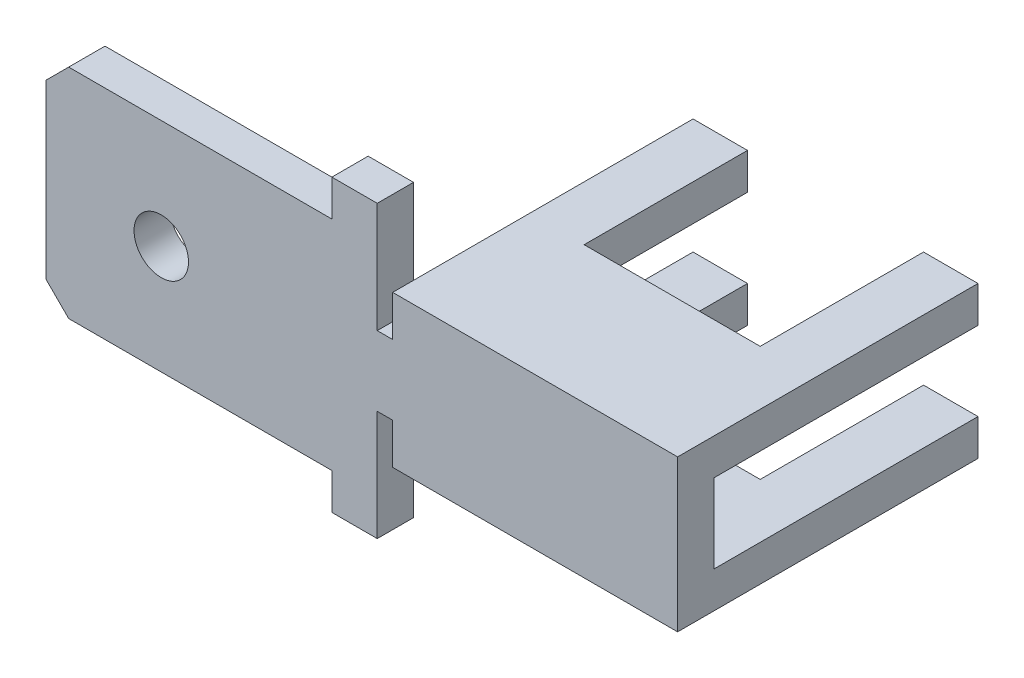
ISO-10303-21;
HEADER;
FILE_DESCRIPTION(('STEP AP214'),'2;1');
FILE_NAME('part.step','',(''),(''),'','','');
FILE_SCHEMA(('AUTOMOTIVE_DESIGN { 1 0 10303 214 1 1 1 1 }'));
ENDSEC;
DATA;
#1=APPLICATION_CONTEXT('core data for automotive mechanical design processes');
#2=APPLICATION_PROTOCOL_DEFINITION('international standard','automotive_design',2000,#1);
#3=PRODUCT_CONTEXT('',#1,'mechanical');
#4=PRODUCT('Part','Part','',(#3));
#5=PRODUCT_RELATED_PRODUCT_CATEGORY('part','',(#4));
#6=PRODUCT_DEFINITION_FORMATION('','',#4);
#7=PRODUCT_DEFINITION_CONTEXT('part definition',#1,'design');
#8=PRODUCT_DEFINITION('design','',#6,#7);
#9=PRODUCT_DEFINITION_SHAPE('','',#8);
#10=(LENGTH_UNIT() NAMED_UNIT(*) SI_UNIT(.MILLI.,.METRE.));
#11=(NAMED_UNIT(*) PLANE_ANGLE_UNIT() SI_UNIT($,.RADIAN.));
#12=(NAMED_UNIT(*) SI_UNIT($,.STERADIAN.) SOLID_ANGLE_UNIT());
#13=UNCERTAINTY_MEASURE_WITH_UNIT(LENGTH_MEASURE(1.E-05),#10,'distance_accuracy_value','');
#14=(GEOMETRIC_REPRESENTATION_CONTEXT(3) GLOBAL_UNCERTAINTY_ASSIGNED_CONTEXT((#13)) GLOBAL_UNIT_ASSIGNED_CONTEXT((#10,
#11,#12)) REPRESENTATION_CONTEXT('',''));
#15=CARTESIAN_POINT('',(0.,0.,0.));
#16=DIRECTION('',(0.,0.,1.));
#17=DIRECTION('',(1.,0.,0.));
#18=AXIS2_PLACEMENT_3D('',#15,#16,#17);
#19=CARTESIAN_POINT('',(0.,0.,6.62));
#20=DIRECTION('',(0.,0.,1.));
#21=DIRECTION('',(1.,0.,0.));
#22=AXIS2_PLACEMENT_3D('',#19,#20,#21);
#23=PLANE('',#22);
#24=CARTESIAN_POINT('',(0.,0.,6.62));
#25=DIRECTION('',(0.,0.,1.));
#26=DIRECTION('',(1.,0.,0.));
#27=AXIS2_PLACEMENT_3D('',#24,#25,#26);
#28=CIRCLE('',#27,0.6);
#29=CARTESIAN_POINT('',(0.6,0.,6.62));
#30=VERTEX_POINT('',#29);
#31=EDGE_CURVE('E419',#30,#30,#28,.T.);
#32=ORIENTED_EDGE('',*,*,#31,.F.);
#33=EDGE_LOOP('',(#32));
#34=FACE_BOUND('',#33,.T.);
#35=DIRECTION('',(1.,0.,0.));
#36=VECTOR('',#35,1.);
#37=CARTESIAN_POINT('',(4.76,1.67,6.62));
#38=LINE('',#37,#36);
#39=CARTESIAN_POINT('',(5.1,1.67,6.62));
#40=VERTEX_POINT('',#39);
#41=CARTESIAN_POINT('',(11.38,1.67,6.62));
#42=VERTEX_POINT('',#41);
#43=EDGE_CURVE('E362',#40,#42,#38,.T.);
#44=ORIENTED_EDGE('',*,*,#43,.F.);
#45=DIRECTION('',(0.,1.,0.));
#46=VECTOR('',#45,1.);
#47=CARTESIAN_POINT('',(5.1,0.77,6.62));
#48=LINE('',#47,#46);
#49=CARTESIAN_POINT('',(5.1,0.77,6.62));
#50=VERTEX_POINT('',#49);
#51=EDGE_CURVE('E256',#50,#40,#48,.T.);
#52=ORIENTED_EDGE('',*,*,#51,.F.);
#53=DIRECTION('',(-1.,0.,0.));
#54=VECTOR('',#53,1.);
#55=CARTESIAN_POINT('',(5.1,0.77,6.62));
#56=LINE('',#55,#54);
#57=CARTESIAN_POINT('',(4.76,0.77,6.62));
#58=VERTEX_POINT('',#57);
#59=EDGE_CURVE('E257',#50,#58,#56,.T.);
#60=ORIENTED_EDGE('',*,*,#59,.T.);
#61=DIRECTION('',(0.,-1.,0.));
#62=VECTOR('',#61,1.);
#63=CARTESIAN_POINT('',(4.76,1.67,6.62));
#64=LINE('',#63,#62);
#65=CARTESIAN_POINT('',(4.76,3.2,6.62));
#66=VERTEX_POINT('',#65);
#67=EDGE_CURVE('E360',#66,#58,#64,.T.);
#68=ORIENTED_EDGE('',*,*,#67,.F.);
#69=DIRECTION('',(-1.,0.,0.));
#70=VECTOR('',#69,1.);
#71=CARTESIAN_POINT('',(11.38,3.2,6.62));
#72=LINE('',#71,#70);
#73=CARTESIAN_POINT('',(3.76,3.2,6.62));
#74=VERTEX_POINT('',#73);
#75=EDGE_CURVE('E438',#66,#74,#72,.T.);
#76=ORIENTED_EDGE('',*,*,#75,.T.);
#77=DIRECTION('',(0.,-1.,0.));
#78=VECTOR('',#77,1.);
#79=CARTESIAN_POINT('',(3.76,2.4,6.62));
#80=LINE('',#79,#78);
#81=CARTESIAN_POINT('',(3.76,2.4,6.62));
#82=VERTEX_POINT('',#81);
#83=EDGE_CURVE('E440',#74,#82,#80,.T.);
#84=ORIENTED_EDGE('',*,*,#83,.T.);
#85=DIRECTION('',(-1.,0.,0.));
#86=VECTOR('',#85,1.);
#87=CARTESIAN_POINT('',(3.76,2.4,6.62));
#88=LINE('',#87,#86);
#89=CARTESIAN_POINT('',(-2.04,2.4,6.62));
#90=VERTEX_POINT('',#89);
#91=EDGE_CURVE('E442',#82,#90,#88,.T.);
#92=ORIENTED_EDGE('',*,*,#91,.T.);
#93=DIRECTION('',(0.70710678118655,0.707106781186545,0.));
#94=VECTOR('',#93,1.);
#95=CARTESIAN_POINT('',(-2.21999999999999,2.22,6.62));
#96=LINE('',#95,#94);
#97=CARTESIAN_POINT('',(-2.54,1.9,6.62));
#98=VERTEX_POINT('',#97);
#99=EDGE_CURVE('E50',#90,#98,#96,.F.);
#100=ORIENTED_EDGE('',*,*,#99,.T.);
#101=DIRECTION('',(0.,-1.,0.));
#102=VECTOR('',#101,1.);
#103=CARTESIAN_POINT('',(-2.54,-2.4,6.62));
#104=LINE('',#103,#102);
#105=CARTESIAN_POINT('',(-2.54,-1.90000000000001,6.62));
#106=VERTEX_POINT('',#105);
#107=EDGE_CURVE('E423',#98,#106,#104,.T.);
#108=ORIENTED_EDGE('',*,*,#107,.T.);
#109=DIRECTION('',(-0.707106781186546,0.707106781186549,0.));
#110=VECTOR('',#109,1.);
#111=CARTESIAN_POINT('',(-2.22000000000001,-2.22,6.62));
#112=LINE('',#111,#110);
#113=CARTESIAN_POINT('',(-2.04,-2.40000000000001,6.62));
#114=VERTEX_POINT('',#113);
#115=EDGE_CURVE('E57',#106,#114,#112,.F.);
#116=ORIENTED_EDGE('',*,*,#115,.T.);
#117=DIRECTION('',(1.,0.,0.));
#118=VECTOR('',#117,1.);
#119=CARTESIAN_POINT('',(3.76,-2.4,6.62));
#120=LINE('',#119,#118);
#121=CARTESIAN_POINT('',(3.76,-2.4,6.62));
#122=VERTEX_POINT('',#121);
#123=EDGE_CURVE('E425',#114,#122,#120,.T.);
#124=ORIENTED_EDGE('',*,*,#123,.T.);
#125=DIRECTION('',(0.,-1.,0.));
#126=VECTOR('',#125,1.);
#127=CARTESIAN_POINT('',(3.76,-3.2,6.62));
#128=LINE('',#127,#126);
#129=CARTESIAN_POINT('',(3.76,-3.2,6.62));
#130=VERTEX_POINT('',#129);
#131=EDGE_CURVE('E429',#122,#130,#128,.T.);
#132=ORIENTED_EDGE('',*,*,#131,.T.);
#133=DIRECTION('',(1.,0.,0.));
#134=VECTOR('',#133,1.);
#135=CARTESIAN_POINT('',(11.38,-3.2,6.62));
#136=LINE('',#135,#134);
#137=CARTESIAN_POINT('',(4.76,-3.2,6.62));
#138=VERTEX_POINT('',#137);
#139=EDGE_CURVE('E431',#130,#138,#136,.T.);
#140=ORIENTED_EDGE('',*,*,#139,.T.);
#141=DIRECTION('',(0.,-1.,0.));
#142=VECTOR('',#141,1.);
#143=CARTESIAN_POINT('',(4.76,-1.67,6.62));
#144=LINE('',#143,#142);
#145=CARTESIAN_POINT('',(4.76,-0.77,6.62));
#146=VERTEX_POINT('',#145);
#147=EDGE_CURVE('E351',#146,#138,#144,.T.);
#148=ORIENTED_EDGE('',*,*,#147,.F.);
#149=DIRECTION('',(-1.,0.,0.));
#150=VECTOR('',#149,1.);
#151=CARTESIAN_POINT('',(5.1,-0.77,6.62));
#152=LINE('',#151,#150);
#153=CARTESIAN_POINT('',(5.1,-0.77,6.62));
#154=VERTEX_POINT('',#153);
#155=EDGE_CURVE('E279',#154,#146,#152,.T.);
#156=ORIENTED_EDGE('',*,*,#155,.F.);
#157=DIRECTION('',(0.,-1.,0.));
#158=VECTOR('',#157,1.);
#159=CARTESIAN_POINT('',(5.1,-0.77,6.62));
#160=LINE('',#159,#158);
#161=CARTESIAN_POINT('',(5.1,-1.67,6.62));
#162=VERTEX_POINT('',#161);
#163=EDGE_CURVE('E288',#154,#162,#160,.T.);
#164=ORIENTED_EDGE('',*,*,#163,.T.);
#165=DIRECTION('',(1.,0.,0.));
#166=VECTOR('',#165,1.);
#167=CARTESIAN_POINT('',(4.76,-1.67,6.62));
#168=LINE('',#167,#166);
#169=CARTESIAN_POINT('',(11.38,-1.67,6.62));
#170=VERTEX_POINT('',#169);
#171=EDGE_CURVE('E355',#162,#170,#168,.T.);
#172=ORIENTED_EDGE('',*,*,#171,.T.);
#173=DIRECTION('',(0.,1.,0.));
#174=VECTOR('',#173,1.);
#175=CARTESIAN_POINT('',(11.38,-3.2,6.62));
#176=LINE('',#175,#174);
#177=EDGE_CURVE('E434',#170,#42,#176,.T.);
#178=ORIENTED_EDGE('',*,*,#177,.T.);
#179=EDGE_LOOP('',(#44,#52,#60,#68,#76,#84,#92,#100,#108,#116,#124,#132,#140,#148,#156,#164,
#172,#178));
#180=FACE_BOUND('',#179,.T.);
#181=ADVANCED_FACE('F42',(#34,#180),#23,.T.);
#182=CARTESIAN_POINT('',(-2.54,-0.869999999999999,5.82));
#183=DIRECTION('',(0.,0.,1.));
#184=DIRECTION('',(1.,0.,0.));
#185=AXIS2_PLACEMENT_3D('',#182,#183,#184);
#186=PLANE('',#185);
#187=CARTESIAN_POINT('',(0.,0.,5.82));
#188=DIRECTION('',(0.,0.,1.));
#189=DIRECTION('',(1.,0.,0.));
#190=AXIS2_PLACEMENT_3D('',#187,#188,#189);
#191=CIRCLE('',#190,0.6);
#192=CARTESIAN_POINT('',(0.6,0.,5.82));
#193=VERTEX_POINT('',#192);
#194=EDGE_CURVE('E409',#193,#193,#191,.T.);
#195=ORIENTED_EDGE('',*,*,#194,.T.);
#196=EDGE_LOOP('',(#195));
#197=FACE_BOUND('',#196,.T.);
#198=DIRECTION('',(0.,1.,0.));
#199=VECTOR('',#198,1.);
#200=CARTESIAN_POINT('',(5.1,0.77,5.82));
#201=LINE('',#200,#199);
#202=CARTESIAN_POINT('',(5.1,0.77,5.82));
#203=VERTEX_POINT('',#202);
#204=CARTESIAN_POINT('',(5.1,0.869999999999999,5.82));
#205=VERTEX_POINT('',#204);
#206=EDGE_CURVE('E245',#203,#205,#201,.T.);
#207=ORIENTED_EDGE('',*,*,#206,.T.);
#208=DIRECTION('',(1.,0.,0.));
#209=VECTOR('',#208,1.);
#210=CARTESIAN_POINT('',(-2.54,0.869999999999999,5.82));
#211=LINE('',#210,#209);
#212=CARTESIAN_POINT('',(11.38,0.869999999999999,5.82));
#213=VERTEX_POINT('',#212);
#214=EDGE_CURVE('E413',#205,#213,#211,.T.);
#215=ORIENTED_EDGE('',*,*,#214,.T.);
#216=DIRECTION('',(0.,-1.,0.));
#217=VECTOR('',#216,1.);
#218=CARTESIAN_POINT('',(11.38,-0.869999999999999,5.82));
#219=LINE('',#218,#217);
#220=CARTESIAN_POINT('',(11.38,-0.869999999999999,5.82));
#221=VERTEX_POINT('',#220);
#222=EDGE_CURVE('E401',#213,#221,#219,.T.);
#223=ORIENTED_EDGE('',*,*,#222,.T.);
#224=DIRECTION('',(1.,0.,0.));
#225=VECTOR('',#224,1.);
#226=CARTESIAN_POINT('',(-2.54,-0.869999999999999,5.82));
#227=LINE('',#226,#225);
#228=CARTESIAN_POINT('',(5.1,-0.869999999999999,5.82));
#229=VERTEX_POINT('',#228);
#230=EDGE_CURVE('E411',#229,#221,#227,.T.);
#231=ORIENTED_EDGE('',*,*,#230,.F.);
#232=DIRECTION('',(0.,-1.,0.));
#233=VECTOR('',#232,1.);
#234=CARTESIAN_POINT('',(5.1,-0.77,5.82));
#235=LINE('',#234,#233);
#236=CARTESIAN_POINT('',(5.1,-0.77,5.82));
#237=VERTEX_POINT('',#236);
#238=EDGE_CURVE('E289',#237,#229,#235,.T.);
#239=ORIENTED_EDGE('',*,*,#238,.F.);
#240=DIRECTION('',(1.,0.,0.));
#241=VECTOR('',#240,1.);
#242=CARTESIAN_POINT('',(5.1,-0.77,5.82));
#243=LINE('',#242,#241);
#244=CARTESIAN_POINT('',(4.76,-0.77,5.82));
#245=VERTEX_POINT('',#244);
#246=EDGE_CURVE('E285',#245,#237,#243,.T.);
#247=ORIENTED_EDGE('',*,*,#246,.F.);
#248=DIRECTION('',(0.,1.,0.));
#249=VECTOR('',#248,1.);
#250=CARTESIAN_POINT('',(4.76,-1.67,5.82));
#251=LINE('',#250,#249);
#252=CARTESIAN_POINT('',(4.76,-3.2,5.82));
#253=VERTEX_POINT('',#252);
#254=EDGE_CURVE('E349',#253,#245,#251,.T.);
#255=ORIENTED_EDGE('',*,*,#254,.F.);
#256=DIRECTION('',(1.,0.,0.));
#257=VECTOR('',#256,1.);
#258=CARTESIAN_POINT('',(-2.54,-3.2,5.82));
#259=LINE('',#258,#257);
#260=CARTESIAN_POINT('',(3.76,-3.2,5.82));
#261=VERTEX_POINT('',#260);
#262=EDGE_CURVE('E369',#261,#253,#259,.T.);
#263=ORIENTED_EDGE('',*,*,#262,.F.);
#264=DIRECTION('',(0.,-1.,0.));
#265=VECTOR('',#264,1.);
#266=CARTESIAN_POINT('',(3.76,-3.2,5.82));
#267=LINE('',#266,#265);
#268=CARTESIAN_POINT('',(3.76,-2.4,5.82));
#269=VERTEX_POINT('',#268);
#270=EDGE_CURVE('E372',#269,#261,#267,.T.);
#271=ORIENTED_EDGE('',*,*,#270,.F.);
#272=DIRECTION('',(1.,0.,0.));
#273=VECTOR('',#272,1.);
#274=CARTESIAN_POINT('',(3.76,-2.4,5.82));
#275=LINE('',#274,#273);
#276=CARTESIAN_POINT('',(-2.04,-2.4,5.82));
#277=VERTEX_POINT('',#276);
#278=EDGE_CURVE('E378',#277,#269,#275,.T.);
#279=ORIENTED_EDGE('',*,*,#278,.F.);
#280=DIRECTION('',(0.707106781186546,-0.707106781186549,0.));
#281=VECTOR('',#280,1.);
#282=CARTESIAN_POINT('',(-2.04,-2.4,5.82));
#283=LINE('',#282,#281);
#284=CARTESIAN_POINT('',(-2.54,-1.90000000000001,5.82));
#285=VERTEX_POINT('',#284);
#286=EDGE_CURVE('E479',#277,#285,#283,.F.);
#287=ORIENTED_EDGE('',*,*,#286,.T.);
#288=DIRECTION('',(0.,-1.,0.));
#289=VECTOR('',#288,1.);
#290=CARTESIAN_POINT('',(-2.54,-0.869999999999999,5.82));
#291=LINE('',#290,#289);
#292=CARTESIAN_POINT('',(-2.54,1.89999999999999,5.82));
#293=VERTEX_POINT('',#292);
#294=EDGE_CURVE('E394',#293,#285,#291,.T.);
#295=ORIENTED_EDGE('',*,*,#294,.F.);
#296=DIRECTION('',(-0.70710678118655,-0.707106781186545,0.));
#297=VECTOR('',#296,1.);
#298=CARTESIAN_POINT('',(-2.54,1.9,5.82));
#299=LINE('',#298,#297);
#300=CARTESIAN_POINT('',(-2.04,2.4,5.82));
#301=VERTEX_POINT('',#300);
#302=EDGE_CURVE('E481',#293,#301,#299,.F.);
#303=ORIENTED_EDGE('',*,*,#302,.T.);
#304=DIRECTION('',(-1.,0.,0.));
#305=VECTOR('',#304,1.);
#306=CARTESIAN_POINT('',(3.76,2.4,5.82));
#307=LINE('',#306,#305);
#308=CARTESIAN_POINT('',(3.76,2.4,5.82));
#309=VERTEX_POINT('',#308);
#310=EDGE_CURVE('E458',#309,#301,#307,.T.);
#311=ORIENTED_EDGE('',*,*,#310,.F.);
#312=DIRECTION('',(0.,-1.,0.));
#313=VECTOR('',#312,1.);
#314=CARTESIAN_POINT('',(3.76,2.4,5.82));
#315=LINE('',#314,#313);
#316=CARTESIAN_POINT('',(3.76,3.2,5.82));
#317=VERTEX_POINT('',#316);
#318=EDGE_CURVE('E388',#317,#309,#315,.T.);
#319=ORIENTED_EDGE('',*,*,#318,.F.);
#320=DIRECTION('',(1.,0.,0.));
#321=VECTOR('',#320,1.);
#322=CARTESIAN_POINT('',(-2.54,3.2,5.82));
#323=LINE('',#322,#321);
#324=CARTESIAN_POINT('',(4.76,3.2,5.82));
#325=VERTEX_POINT('',#324);
#326=EDGE_CURVE('E384',#317,#325,#323,.T.);
#327=ORIENTED_EDGE('',*,*,#326,.T.);
#328=DIRECTION('',(0.,1.,0.));
#329=VECTOR('',#328,1.);
#330=CARTESIAN_POINT('',(4.76,1.67,5.82));
#331=LINE('',#330,#329);
#332=CARTESIAN_POINT('',(4.76,0.77,5.82));
#333=VERTEX_POINT('',#332);
#334=EDGE_CURVE('E268',#333,#325,#331,.T.);
#335=ORIENTED_EDGE('',*,*,#334,.F.);
#336=DIRECTION('',(1.,0.,0.));
#337=VECTOR('',#336,1.);
#338=CARTESIAN_POINT('',(5.1,0.77,5.82));
#339=LINE('',#338,#337);
#340=EDGE_CURVE('E263',#333,#203,#339,.T.);
#341=ORIENTED_EDGE('',*,*,#340,.T.);
#342=EDGE_LOOP('',(#207,#215,#223,#231,#239,#247,#255,#263,#271,#279,#287,#295,#303,#311,#319,
#327,#335,#341));
#343=FACE_BOUND('',#342,.T.);
#344=ADVANCED_FACE('F266',(#197,#343),#186,.F.);
#345=CARTESIAN_POINT('',(-2.54,1.67,0.));
#346=DIRECTION('',(0.,-1.,0.));
#347=DIRECTION('',(0.,0.,-1.));
#348=AXIS2_PLACEMENT_3D('',#345,#346,#347);
#349=PLANE('',#348);
#350=DIRECTION('',(0.,0.,1.));
#351=VECTOR('',#350,1.);
#352=CARTESIAN_POINT('',(5.1,1.67,0.));
#353=LINE('',#352,#351);
#354=CARTESIAN_POINT('',(5.1,1.67,0.));
#355=VERTEX_POINT('',#354);
#356=EDGE_CURVE('E341',#355,#40,#353,.T.);
#357=ORIENTED_EDGE('',*,*,#356,.T.);
#358=ORIENTED_EDGE('',*,*,#43,.T.);
#359=DIRECTION('',(0.,0.,-1.));
#360=VECTOR('',#359,1.);
#361=CARTESIAN_POINT('',(11.38,1.67,0.));
#362=LINE('',#361,#360);
#363=CARTESIAN_POINT('',(11.38,1.67,0.));
#364=VERTEX_POINT('',#363);
#365=EDGE_CURVE('E380',#42,#364,#362,.T.);
#366=ORIENTED_EDGE('',*,*,#365,.T.);
#367=DIRECTION('',(1.,0.,0.));
#368=VECTOR('',#367,1.);
#369=CARTESIAN_POINT('',(-2.54,1.67,0.));
#370=LINE('',#369,#368);
#371=CARTESIAN_POINT('',(10.18,1.67,0.));
#372=VERTEX_POINT('',#371);
#373=EDGE_CURVE('E389',#372,#364,#370,.T.);
#374=ORIENTED_EDGE('',*,*,#373,.F.);
#375=DIRECTION('',(0.,0.,1.));
#376=VECTOR('',#375,1.);
#377=CARTESIAN_POINT('',(10.18,1.67,0.));
#378=LINE('',#377,#376);
#379=CARTESIAN_POINT('',(10.18,1.67,3.6));
#380=VERTEX_POINT('',#379);
#381=EDGE_CURVE('E318',#372,#380,#378,.T.);
#382=ORIENTED_EDGE('',*,*,#381,.T.);
#383=DIRECTION('',(-1.,0.,0.));
#384=VECTOR('',#383,1.);
#385=CARTESIAN_POINT('',(-2.54,1.67,3.6));
#386=LINE('',#385,#384);
#387=CARTESIAN_POINT('',(6.3,1.67,3.6));
#388=VERTEX_POINT('',#387);
#389=EDGE_CURVE('E327',#380,#388,#386,.T.);
#390=ORIENTED_EDGE('',*,*,#389,.T.);
#391=DIRECTION('',(0.,0.,-1.));
#392=VECTOR('',#391,1.);
#393=CARTESIAN_POINT('',(6.3,1.67,0.));
#394=LINE('',#393,#392);
#395=CARTESIAN_POINT('',(6.3,1.67,0.));
#396=VERTEX_POINT('',#395);
#397=EDGE_CURVE('E307',#388,#396,#394,.T.);
#398=ORIENTED_EDGE('',*,*,#397,.T.);
#399=EDGE_CURVE('E385',#355,#396,#370,.T.);
#400=ORIENTED_EDGE('',*,*,#399,.F.);
#401=EDGE_LOOP('',(#357,#358,#366,#374,#382,#390,#398,#400));
#402=FACE_BOUND('',#401,.T.);
#403=ADVANCED_FACE('F515',(#402),#349,.F.);
#404=CARTESIAN_POINT('',(0.,0.,0.));
#405=DIRECTION('',(0.,0.,1.));
#406=DIRECTION('',(1.,0.,0.));
#407=AXIS2_PLACEMENT_3D('',#404,#405,#406);
#408=PLANE('',#407);
#409=DIRECTION('',(1.,0.,0.));
#410=VECTOR('',#409,1.);
#411=CARTESIAN_POINT('',(-2.54,-1.67,0.));
#412=LINE('',#411,#410);
#413=CARTESIAN_POINT('',(10.18,-1.67,0.));
#414=VERTEX_POINT('',#413);
#415=CARTESIAN_POINT('',(11.38,-1.67,0.));
#416=VERTEX_POINT('',#415);
#417=EDGE_CURVE('E368',#414,#416,#412,.T.);
#418=ORIENTED_EDGE('',*,*,#417,.F.);
#419=DIRECTION('',(0.,-1.,0.));
#420=VECTOR('',#419,1.);
#421=CARTESIAN_POINT('',(10.18,3.2,0.));
#422=LINE('',#421,#420);
#423=CARTESIAN_POINT('',(10.18,-0.869999999999999,0.));
#424=VERTEX_POINT('',#423);
#425=EDGE_CURVE('E299',#424,#414,#422,.T.);
#426=ORIENTED_EDGE('',*,*,#425,.F.);
#427=DIRECTION('',(1.,0.,0.));
#428=VECTOR('',#427,1.);
#429=CARTESIAN_POINT('',(-2.54,-0.869999999999999,0.));
#430=LINE('',#429,#428);
#431=CARTESIAN_POINT('',(11.38,-0.869999999999999,0.));
#432=VERTEX_POINT('',#431);
#433=EDGE_CURVE('E410',#424,#432,#430,.T.);
#434=ORIENTED_EDGE('',*,*,#433,.T.);
#435=DIRECTION('',(0.,1.,0.));
#436=VECTOR('',#435,1.);
#437=CARTESIAN_POINT('',(11.38,-3.2,0.));
#438=LINE('',#437,#436);
#439=EDGE_CURVE('E426',#416,#432,#438,.T.);
#440=ORIENTED_EDGE('',*,*,#439,.F.);
#441=EDGE_LOOP('',(#418,#426,#434,#440));
#442=FACE_BOUND('',#441,.T.);
#443=ADVANCED_FACE('F594',(#442),#408,.F.);
#444=DIRECTION('',(1.,0.,0.));
#445=VECTOR('',#444,1.);
#446=CARTESIAN_POINT('',(-2.54,0.869999999999999,0.));
#447=LINE('',#446,#445);
#448=CARTESIAN_POINT('',(10.18,0.869999999999999,0.));
#449=VERTEX_POINT('',#448);
#450=CARTESIAN_POINT('',(11.38,0.869999999999999,0.));
#451=VERTEX_POINT('',#450);
#452=EDGE_CURVE('E397',#449,#451,#447,.T.);
#453=ORIENTED_EDGE('',*,*,#452,.F.);
#454=EDGE_CURVE('E298',#372,#449,#422,.T.);
#455=ORIENTED_EDGE('',*,*,#454,.F.);
#456=ORIENTED_EDGE('',*,*,#373,.T.);
#457=EDGE_CURVE('E422',#451,#364,#438,.T.);
#458=ORIENTED_EDGE('',*,*,#457,.F.);
#459=EDGE_LOOP('',(#453,#455,#456,#458));
#460=FACE_BOUND('',#459,.T.);
#461=ADVANCED_FACE('F601',(#460),#408,.F.);
#462=CARTESIAN_POINT('',(11.38,3.2,6.62));
#463=DIRECTION('',(0.,-1.,0.));
#464=DIRECTION('',(1.,0.,0.));
#465=AXIS2_PLACEMENT_3D('',#462,#463,#464);
#466=PLANE('',#465);
#467=DIRECTION('',(0.,0.,1.));
#468=VECTOR('',#467,1.);
#469=CARTESIAN_POINT('',(4.76,3.2,5.82));
#470=LINE('',#469,#468);
#471=EDGE_CURVE('E358',#325,#66,#470,.T.);
#472=ORIENTED_EDGE('',*,*,#471,.F.);
#473=ORIENTED_EDGE('',*,*,#326,.F.);
#474=DIRECTION('',(0.,0.,-1.));
#475=VECTOR('',#474,1.);
#476=CARTESIAN_POINT('',(3.76,3.2,6.62));
#477=LINE('',#476,#475);
#478=EDGE_CURVE('E449',#74,#317,#477,.T.);
#479=ORIENTED_EDGE('',*,*,#478,.F.);
#480=ORIENTED_EDGE('',*,*,#75,.F.);
#481=EDGE_LOOP('',(#472,#473,#479,#480));
#482=FACE_BOUND('',#481,.T.);
#483=ADVANCED_FACE('F503',(#482),#466,.F.);
#484=CARTESIAN_POINT('',(5.1,-0.869999999999999,0.));
#485=VERTEX_POINT('',#484);
#486=CARTESIAN_POINT('',(6.3,-0.87,0.));
#487=VERTEX_POINT('',#486);
#488=EDGE_CURVE('E406',#485,#487,#430,.T.);
#489=ORIENTED_EDGE('',*,*,#488,.T.);
#490=DIRECTION('',(0.,-1.,0.));
#491=VECTOR('',#490,1.);
#492=CARTESIAN_POINT('',(6.3,3.2,0.));
#493=LINE('',#492,#491);
#494=CARTESIAN_POINT('',(6.3,-1.67,0.));
#495=VERTEX_POINT('',#494);
#496=EDGE_CURVE('E302',#487,#495,#493,.T.);
#497=ORIENTED_EDGE('',*,*,#496,.T.);
#498=CARTESIAN_POINT('',(5.1,-1.67,0.));
#499=VERTEX_POINT('',#498);
#500=EDGE_CURVE('E373',#499,#495,#412,.T.);
#501=ORIENTED_EDGE('',*,*,#500,.F.);
#502=DIRECTION('',(0.,-1.,0.));
#503=VECTOR('',#502,1.);
#504=CARTESIAN_POINT('',(5.1,3.2,0.));
#505=LINE('',#504,#503);
#506=EDGE_CURVE('E338',#485,#499,#505,.T.);
#507=ORIENTED_EDGE('',*,*,#506,.F.);
#508=EDGE_LOOP('',(#489,#497,#501,#507));
#509=FACE_BOUND('',#508,.T.);
#510=ADVANCED_FACE('F547',(#509),#408,.F.);
#511=ORIENTED_EDGE('',*,*,#399,.T.);
#512=CARTESIAN_POINT('',(6.3,0.869999999999999,0.));
#513=VERTEX_POINT('',#512);
#514=EDGE_CURVE('E301',#396,#513,#493,.T.);
#515=ORIENTED_EDGE('',*,*,#514,.T.);
#516=CARTESIAN_POINT('',(5.1,0.869999999999999,0.));
#517=VERTEX_POINT('',#516);
#518=EDGE_CURVE('E416',#517,#513,#447,.T.);
#519=ORIENTED_EDGE('',*,*,#518,.F.);
#520=EDGE_CURVE('E340',#355,#517,#505,.T.);
#521=ORIENTED_EDGE('',*,*,#520,.F.);
#522=EDGE_LOOP('',(#511,#515,#519,#521));
#523=FACE_BOUND('',#522,.T.);
#524=ADVANCED_FACE('F513',(#523),#408,.F.);
#525=CARTESIAN_POINT('',(-2.54,-2.4,6.62));
#526=DIRECTION('',(1.,0.,0.));
#527=DIRECTION('',(0.,1.,0.));
#528=AXIS2_PLACEMENT_3D('',#525,#526,#527);
#529=PLANE('',#528);
#530=ORIENTED_EDGE('',*,*,#107,.F.);
#531=DIRECTION('',(0.,0.,-1.));
#532=VECTOR('',#531,1.);
#533=CARTESIAN_POINT('',(-2.54,1.9,6.62));
#534=LINE('',#533,#532);
#535=EDGE_CURVE('E476',#98,#293,#534,.T.);
#536=ORIENTED_EDGE('',*,*,#535,.T.);
#537=ORIENTED_EDGE('',*,*,#294,.T.);
#538=DIRECTION('',(0.,0.,1.));
#539=VECTOR('',#538,1.);
#540=CARTESIAN_POINT('',(-2.54,-1.90000000000001,6.62));
#541=LINE('',#540,#539);
#542=EDGE_CURVE('E474',#285,#106,#541,.T.);
#543=ORIENTED_EDGE('',*,*,#542,.T.);
#544=EDGE_LOOP('',(#530,#536,#537,#543));
#545=FACE_BOUND('',#544,.T.);
#546=ADVANCED_FACE('F490',(#545),#529,.F.);
#547=CARTESIAN_POINT('',(3.76,-2.4,6.62));
#548=DIRECTION('',(0.,1.,0.));
#549=DIRECTION('',(-1.,0.,0.));
#550=AXIS2_PLACEMENT_3D('',#547,#548,#549);
#551=PLANE('',#550);
#552=ORIENTED_EDGE('',*,*,#123,.F.);
#553=DIRECTION('',(0.,0.,-1.));
#554=VECTOR('',#553,1.);
#555=CARTESIAN_POINT('',(-2.04,-2.4,6.62));
#556=LINE('',#555,#554);
#557=EDGE_CURVE('E12',#114,#277,#556,.T.);
#558=ORIENTED_EDGE('',*,*,#557,.T.);
#559=ORIENTED_EDGE('',*,*,#278,.T.);
#560=DIRECTION('',(0.,0.,-1.));
#561=VECTOR('',#560,1.);
#562=CARTESIAN_POINT('',(3.76,-2.4,6.62));
#563=LINE('',#562,#561);
#564=EDGE_CURVE('E455',#122,#269,#563,.T.);
#565=ORIENTED_EDGE('',*,*,#564,.F.);
#566=EDGE_LOOP('',(#552,#558,#559,#565));
#567=FACE_BOUND('',#566,.T.);
#568=ADVANCED_FACE('F570',(#567),#551,.F.);
#569=CARTESIAN_POINT('',(3.76,-3.2,6.62));
#570=DIRECTION('',(1.,0.,0.));
#571=DIRECTION('',(0.,1.,0.));
#572=AXIS2_PLACEMENT_3D('',#569,#570,#571);
#573=PLANE('',#572);
#574=ORIENTED_EDGE('',*,*,#564,.T.);
#575=ORIENTED_EDGE('',*,*,#270,.T.);
#576=DIRECTION('',(0.,0.,-1.));
#577=VECTOR('',#576,1.);
#578=CARTESIAN_POINT('',(3.76,-3.2,6.62));
#579=LINE('',#578,#577);
#580=EDGE_CURVE('E452',#130,#261,#579,.T.);
#581=ORIENTED_EDGE('',*,*,#580,.F.);
#582=ORIENTED_EDGE('',*,*,#131,.F.);
#583=EDGE_LOOP('',(#574,#575,#581,#582));
#584=FACE_BOUND('',#583,.T.);
#585=ADVANCED_FACE('F566',(#584),#573,.F.);
#586=CARTESIAN_POINT('',(11.38,-3.2,6.62));
#587=DIRECTION('',(0.,1.,0.));
#588=DIRECTION('',(-1.,0.,0.));
#589=AXIS2_PLACEMENT_3D('',#586,#587,#588);
#590=PLANE('',#589);
#591=ORIENTED_EDGE('',*,*,#262,.T.);
#592=DIRECTION('',(0.,0.,-1.));
#593=VECTOR('',#592,1.);
#594=CARTESIAN_POINT('',(4.76,-3.2,5.82));
#595=LINE('',#594,#593);
#596=EDGE_CURVE('E353',#138,#253,#595,.T.);
#597=ORIENTED_EDGE('',*,*,#596,.F.);
#598=ORIENTED_EDGE('',*,*,#139,.F.);
#599=ORIENTED_EDGE('',*,*,#580,.T.);
#600=EDGE_LOOP('',(#591,#597,#598,#599));
#601=FACE_BOUND('',#600,.T.);
#602=ADVANCED_FACE('F561',(#601),#590,.F.);
#603=CARTESIAN_POINT('',(11.38,-3.2,6.62));
#604=DIRECTION('',(-1.,0.,0.));
#605=DIRECTION('',(0.,0.,1.));
#606=AXIS2_PLACEMENT_3D('',#603,#604,#605);
#607=PLANE('',#606);
#608=ORIENTED_EDGE('',*,*,#177,.F.);
#609=DIRECTION('',(0.,0.,1.));
#610=VECTOR('',#609,1.);
#611=CARTESIAN_POINT('',(11.38,-1.67,0.));
#612=LINE('',#611,#610);
#613=EDGE_CURVE('E365',#416,#170,#612,.T.);
#614=ORIENTED_EDGE('',*,*,#613,.F.);
#615=ORIENTED_EDGE('',*,*,#439,.T.);
#616=DIRECTION('',(0.,0.,-1.));
#617=VECTOR('',#616,1.);
#618=CARTESIAN_POINT('',(11.38,-0.869999999999999,5.82));
#619=LINE('',#618,#617);
#620=EDGE_CURVE('E398',#221,#432,#619,.T.);
#621=ORIENTED_EDGE('',*,*,#620,.F.);
#622=ORIENTED_EDGE('',*,*,#222,.F.);
#623=DIRECTION('',(0.,0.,1.));
#624=VECTOR('',#623,1.);
#625=CARTESIAN_POINT('',(11.38,0.869999999999999,5.82));
#626=LINE('',#625,#624);
#627=EDGE_CURVE('E393',#451,#213,#626,.T.);
#628=ORIENTED_EDGE('',*,*,#627,.F.);
#629=ORIENTED_EDGE('',*,*,#457,.T.);
#630=ORIENTED_EDGE('',*,*,#365,.F.);
#631=EDGE_LOOP('',(#608,#614,#615,#621,#622,#628,#629,#630));
#632=FACE_BOUND('',#631,.T.);
#633=ADVANCED_FACE('F535',(#632),#607,.F.);
#634=CARTESIAN_POINT('',(3.76,2.4,6.62));
#635=DIRECTION('',(1.,0.,0.));
#636=DIRECTION('',(0.,1.,0.));
#637=AXIS2_PLACEMENT_3D('',#634,#635,#636);
#638=PLANE('',#637);
#639=ORIENTED_EDGE('',*,*,#478,.T.);
#640=ORIENTED_EDGE('',*,*,#318,.T.);
#641=DIRECTION('',(0.,0.,-1.));
#642=VECTOR('',#641,1.);
#643=CARTESIAN_POINT('',(3.76,2.4,6.62));
#644=LINE('',#643,#642);
#645=EDGE_CURVE('E444',#82,#309,#644,.T.);
#646=ORIENTED_EDGE('',*,*,#645,.F.);
#647=ORIENTED_EDGE('',*,*,#83,.F.);
#648=EDGE_LOOP('',(#639,#640,#646,#647));
#649=FACE_BOUND('',#648,.T.);
#650=ADVANCED_FACE('F498',(#649),#638,.F.);
#651=CARTESIAN_POINT('',(3.76,2.4,6.62));
#652=DIRECTION('',(0.,-1.,0.));
#653=DIRECTION('',(1.,0.,0.));
#654=AXIS2_PLACEMENT_3D('',#651,#652,#653);
#655=PLANE('',#654);
#656=ORIENTED_EDGE('',*,*,#310,.T.);
#657=DIRECTION('',(0.,0.,1.));
#658=VECTOR('',#657,1.);
#659=CARTESIAN_POINT('',(-2.04,2.4,6.62));
#660=LINE('',#659,#658);
#661=EDGE_CURVE('E65',#301,#90,#660,.T.);
#662=ORIENTED_EDGE('',*,*,#661,.T.);
#663=ORIENTED_EDGE('',*,*,#91,.F.);
#664=ORIENTED_EDGE('',*,*,#645,.T.);
#665=EDGE_LOOP('',(#656,#662,#663,#664));
#666=FACE_BOUND('',#665,.T.);
#667=ADVANCED_FACE('F494',(#666),#655,.F.);
#668=CARTESIAN_POINT('',(0.,0.,6.62));
#669=DIRECTION('',(0.,0.,-1.));
#670=DIRECTION('',(-1.,0.,0.));
#671=AXIS2_PLACEMENT_3D('',#668,#669,#670);
#672=CYLINDRICAL_SURFACE('',#671,0.6);
#673=ORIENTED_EDGE('',*,*,#194,.F.);
#674=EDGE_LOOP('',(#673));
#675=FACE_BOUND('',#674,.T.);
#676=ORIENTED_EDGE('',*,*,#31,.T.);
#677=EDGE_LOOP('',(#676));
#678=FACE_BOUND('',#677,.T.);
#679=ADVANCED_FACE('F590',(#675,#678),#672,.F.);
#680=CARTESIAN_POINT('',(-2.54,-0.869999999999999,5.82));
#681=DIRECTION('',(0.,-1.,0.));
#682=DIRECTION('',(0.,0.,-1.));
#683=AXIS2_PLACEMENT_3D('',#680,#681,#682);
#684=PLANE('',#683);
#685=ORIENTED_EDGE('',*,*,#433,.F.);
#686=DIRECTION('',(0.,0.,1.));
#687=VECTOR('',#686,1.);
#688=CARTESIAN_POINT('',(10.18,-0.869999999999999,5.82));
#689=LINE('',#688,#687);
#690=CARTESIAN_POINT('',(10.18,-0.869999999999999,3.6));
#691=VERTEX_POINT('',#690);
#692=EDGE_CURVE('E324',#424,#691,#689,.T.);
#693=ORIENTED_EDGE('',*,*,#692,.T.);
#694=DIRECTION('',(-1.,0.,0.));
#695=VECTOR('',#694,1.);
#696=CARTESIAN_POINT('',(-2.54,-0.869999999999999,3.6));
#697=LINE('',#696,#695);
#698=CARTESIAN_POINT('',(6.3,-0.87,3.6));
#699=VERTEX_POINT('',#698);
#700=EDGE_CURVE('E335',#691,#699,#697,.T.);
#701=ORIENTED_EDGE('',*,*,#700,.T.);
#702=DIRECTION('',(0.,0.,-1.));
#703=VECTOR('',#702,1.);
#704=CARTESIAN_POINT('',(6.3,-0.869999999999999,5.82));
#705=LINE('',#704,#703);
#706=EDGE_CURVE('E315',#699,#487,#705,.T.);
#707=ORIENTED_EDGE('',*,*,#706,.T.);
#708=ORIENTED_EDGE('',*,*,#488,.F.);
#709=DIRECTION('',(0.,0.,1.));
#710=VECTOR('',#709,1.);
#711=CARTESIAN_POINT('',(5.1,-0.869999999999999,5.82));
#712=LINE('',#711,#710);
#713=EDGE_CURVE('E346',#485,#229,#712,.T.);
#714=ORIENTED_EDGE('',*,*,#713,.T.);
#715=ORIENTED_EDGE('',*,*,#230,.T.);
#716=ORIENTED_EDGE('',*,*,#620,.T.);
#717=EDGE_LOOP('',(#685,#693,#701,#707,#708,#714,#715,#716));
#718=FACE_BOUND('',#717,.T.);
#719=ADVANCED_FACE('F540',(#718),#684,.F.);
#720=CARTESIAN_POINT('',(-2.54,0.869999999999999,5.82));
#721=DIRECTION('',(0.,1.,0.));
#722=DIRECTION('',(0.,0.,1.));
#723=AXIS2_PLACEMENT_3D('',#720,#721,#722);
#724=PLANE('',#723);
#725=DIRECTION('',(1.,0.,0.));
#726=VECTOR('',#725,1.);
#727=CARTESIAN_POINT('',(-2.54,0.869999999999999,3.6));
#728=LINE('',#727,#726);
#729=CARTESIAN_POINT('',(6.3,0.869999999999999,3.6));
#730=VERTEX_POINT('',#729);
#731=CARTESIAN_POINT('',(10.18,0.869999999999999,3.6));
#732=VERTEX_POINT('',#731);
#733=EDGE_CURVE('E331',#730,#732,#728,.T.);
#734=ORIENTED_EDGE('',*,*,#733,.T.);
#735=DIRECTION('',(0.,0.,-1.));
#736=VECTOR('',#735,1.);
#737=CARTESIAN_POINT('',(10.18,0.869999999999999,5.82));
#738=LINE('',#737,#736);
#739=EDGE_CURVE('E321',#732,#449,#738,.T.);
#740=ORIENTED_EDGE('',*,*,#739,.T.);
#741=ORIENTED_EDGE('',*,*,#452,.T.);
#742=ORIENTED_EDGE('',*,*,#627,.T.);
#743=ORIENTED_EDGE('',*,*,#214,.F.);
#744=DIRECTION('',(0.,0.,-1.));
#745=VECTOR('',#744,1.);
#746=CARTESIAN_POINT('',(5.1,0.869999999999999,5.82));
#747=LINE('',#746,#745);
#748=EDGE_CURVE('E252',#205,#517,#747,.T.);
#749=ORIENTED_EDGE('',*,*,#748,.T.);
#750=ORIENTED_EDGE('',*,*,#518,.T.);
#751=DIRECTION('',(0.,0.,1.));
#752=VECTOR('',#751,1.);
#753=CARTESIAN_POINT('',(6.3,0.869999999999999,5.82));
#754=LINE('',#753,#752);
#755=EDGE_CURVE('E311',#513,#730,#754,.T.);
#756=ORIENTED_EDGE('',*,*,#755,.T.);
#757=EDGE_LOOP('',(#734,#740,#741,#742,#743,#749,#750,#756));
#758=FACE_BOUND('',#757,.T.);
#759=ADVANCED_FACE('F526',(#758),#724,.F.);
#760=CARTESIAN_POINT('',(-2.54,-1.67,0.));
#761=DIRECTION('',(0.,1.,0.));
#762=DIRECTION('',(0.,0.,1.));
#763=AXIS2_PLACEMENT_3D('',#760,#761,#762);
#764=PLANE('',#763);
#765=ORIENTED_EDGE('',*,*,#171,.F.);
#766=DIRECTION('',(0.,0.,-1.));
#767=VECTOR('',#766,1.);
#768=CARTESIAN_POINT('',(5.1,-1.67,0.));
#769=LINE('',#768,#767);
#770=EDGE_CURVE('E462',#162,#499,#769,.T.);
#771=ORIENTED_EDGE('',*,*,#770,.T.);
#772=ORIENTED_EDGE('',*,*,#500,.T.);
#773=DIRECTION('',(0.,0.,1.));
#774=VECTOR('',#773,1.);
#775=CARTESIAN_POINT('',(6.3,-1.67,0.));
#776=LINE('',#775,#774);
#777=CARTESIAN_POINT('',(6.3,-1.67,3.6));
#778=VERTEX_POINT('',#777);
#779=EDGE_CURVE('E465',#495,#778,#776,.T.);
#780=ORIENTED_EDGE('',*,*,#779,.T.);
#781=DIRECTION('',(1.,0.,0.));
#782=VECTOR('',#781,1.);
#783=CARTESIAN_POINT('',(-2.54,-1.67,3.6));
#784=LINE('',#783,#782);
#785=CARTESIAN_POINT('',(10.18,-1.67,3.6));
#786=VERTEX_POINT('',#785);
#787=EDGE_CURVE('E468',#778,#786,#784,.T.);
#788=ORIENTED_EDGE('',*,*,#787,.T.);
#789=DIRECTION('',(0.,0.,-1.));
#790=VECTOR('',#789,1.);
#791=CARTESIAN_POINT('',(10.18,-1.67,0.));
#792=LINE('',#791,#790);
#793=EDGE_CURVE('E471',#786,#414,#792,.T.);
#794=ORIENTED_EDGE('',*,*,#793,.T.);
#795=ORIENTED_EDGE('',*,*,#417,.T.);
#796=ORIENTED_EDGE('',*,*,#613,.T.);
#797=EDGE_LOOP('',(#765,#771,#772,#780,#788,#794,#795,#796));
#798=FACE_BOUND('',#797,.T.);
#799=ADVANCED_FACE('F550',(#798),#764,.F.);
#800=CARTESIAN_POINT('',(4.76,0.,0.));
#801=DIRECTION('',(1.,0.,0.));
#802=DIRECTION('',(0.,0.,-1.));
#803=AXIS2_PLACEMENT_3D('',#800,#801,#802);
#804=PLANE('',#803);
#805=ORIENTED_EDGE('',*,*,#334,.T.);
#806=ORIENTED_EDGE('',*,*,#471,.T.);
#807=ORIENTED_EDGE('',*,*,#67,.T.);
#808=DIRECTION('',(0.,0.,-1.));
#809=VECTOR('',#808,1.);
#810=CARTESIAN_POINT('',(4.76,0.77,5.82));
#811=LINE('',#810,#809);
#812=EDGE_CURVE('E270',#58,#333,#811,.T.);
#813=ORIENTED_EDGE('',*,*,#812,.T.);
#814=EDGE_LOOP('',(#805,#806,#807,#813));
#815=FACE_BOUND('',#814,.T.);
#816=ADVANCED_FACE('F507',(#815),#804,.T.);
#817=CARTESIAN_POINT('',(4.76,0.,0.));
#818=DIRECTION('',(-1.,0.,0.));
#819=DIRECTION('',(0.,0.,1.));
#820=AXIS2_PLACEMENT_3D('',#817,#818,#819);
#821=PLANE('',#820);
#822=ORIENTED_EDGE('',*,*,#254,.T.);
#823=DIRECTION('',(0.,0.,-1.));
#824=VECTOR('',#823,1.);
#825=CARTESIAN_POINT('',(4.76,-0.77,5.82));
#826=LINE('',#825,#824);
#827=EDGE_CURVE('E282',#146,#245,#826,.T.);
#828=ORIENTED_EDGE('',*,*,#827,.F.);
#829=ORIENTED_EDGE('',*,*,#147,.T.);
#830=ORIENTED_EDGE('',*,*,#596,.T.);
#831=EDGE_LOOP('',(#822,#828,#829,#830));
#832=FACE_BOUND('',#831,.T.);
#833=ADVANCED_FACE('F673',(#832),#821,.F.);
#834=CARTESIAN_POINT('',(5.1,3.2,5.82));
#835=DIRECTION('',(1.,0.,0.));
#836=DIRECTION('',(0.,0.,-1.));
#837=AXIS2_PLACEMENT_3D('',#834,#835,#836);
#838=PLANE('',#837);
#839=ORIENTED_EDGE('',*,*,#506,.T.);
#840=ORIENTED_EDGE('',*,*,#770,.F.);
#841=ORIENTED_EDGE('',*,*,#163,.F.);
#842=DIRECTION('',(0.,0.,1.));
#843=VECTOR('',#842,1.);
#844=CARTESIAN_POINT('',(5.1,-0.77,5.82));
#845=LINE('',#844,#843);
#846=EDGE_CURVE('E275',#237,#154,#845,.T.);
#847=ORIENTED_EDGE('',*,*,#846,.F.);
#848=ORIENTED_EDGE('',*,*,#238,.T.);
#849=ORIENTED_EDGE('',*,*,#713,.F.);
#850=EDGE_LOOP('',(#839,#840,#841,#847,#848,#849));
#851=FACE_BOUND('',#850,.T.);
#852=ADVANCED_FACE('F544',(#851),#838,.F.);
#853=ORIENTED_EDGE('',*,*,#748,.F.);
#854=ORIENTED_EDGE('',*,*,#206,.F.);
#855=DIRECTION('',(0.,0.,1.));
#856=VECTOR('',#855,1.);
#857=CARTESIAN_POINT('',(5.1,0.77,5.82));
#858=LINE('',#857,#856);
#859=EDGE_CURVE('E249',#203,#50,#858,.T.);
#860=ORIENTED_EDGE('',*,*,#859,.T.);
#861=ORIENTED_EDGE('',*,*,#51,.T.);
#862=ORIENTED_EDGE('',*,*,#356,.F.);
#863=ORIENTED_EDGE('',*,*,#520,.T.);
#864=EDGE_LOOP('',(#853,#854,#860,#861,#862,#863));
#865=FACE_BOUND('',#864,.T.);
#866=ADVANCED_FACE('F247',(#865),#838,.F.);
#867=CARTESIAN_POINT('',(6.3,3.2,3.6));
#868=DIRECTION('',(-1.,0.,0.));
#869=DIRECTION('',(0.,0.,1.));
#870=AXIS2_PLACEMENT_3D('',#867,#868,#869);
#871=PLANE('',#870);
#872=DIRECTION('',(0.,-1.,0.));
#873=VECTOR('',#872,1.);
#874=CARTESIAN_POINT('',(6.3,3.2,3.6));
#875=LINE('',#874,#873);
#876=EDGE_CURVE('E291',#699,#778,#875,.T.);
#877=ORIENTED_EDGE('',*,*,#876,.T.);
#878=ORIENTED_EDGE('',*,*,#779,.F.);
#879=ORIENTED_EDGE('',*,*,#496,.F.);
#880=ORIENTED_EDGE('',*,*,#706,.F.);
#881=EDGE_LOOP('',(#877,#878,#879,#880));
#882=FACE_BOUND('',#881,.T.);
#883=ADVANCED_FACE('F692',(#882),#871,.F.);
#884=CARTESIAN_POINT('',(10.18,3.2,3.6));
#885=DIRECTION('',(1.,0.,0.));
#886=DIRECTION('',(0.,1.,0.));
#887=AXIS2_PLACEMENT_3D('',#884,#885,#886);
#888=PLANE('',#887);
#889=ORIENTED_EDGE('',*,*,#425,.T.);
#890=ORIENTED_EDGE('',*,*,#793,.F.);
#891=DIRECTION('',(0.,-1.,0.));
#892=VECTOR('',#891,1.);
#893=CARTESIAN_POINT('',(10.18,3.2,3.6));
#894=LINE('',#893,#892);
#895=EDGE_CURVE('E294',#691,#786,#894,.T.);
#896=ORIENTED_EDGE('',*,*,#895,.F.);
#897=ORIENTED_EDGE('',*,*,#692,.F.);
#898=EDGE_LOOP('',(#889,#890,#896,#897));
#899=FACE_BOUND('',#898,.T.);
#900=ADVANCED_FACE('F696',(#899),#888,.F.);
#901=CARTESIAN_POINT('',(6.3,3.2,3.6));
#902=DIRECTION('',(0.,0.,1.));
#903=DIRECTION('',(1.,0.,0.));
#904=AXIS2_PLACEMENT_3D('',#901,#902,#903);
#905=PLANE('',#904);
#906=ORIENTED_EDGE('',*,*,#895,.T.);
#907=ORIENTED_EDGE('',*,*,#787,.F.);
#908=ORIENTED_EDGE('',*,*,#876,.F.);
#909=ORIENTED_EDGE('',*,*,#700,.F.);
#910=EDGE_LOOP('',(#906,#907,#908,#909));
#911=FACE_BOUND('',#910,.T.);
#912=ADVANCED_FACE('F704',(#911),#905,.F.);
#913=EDGE_CURVE('E305',#388,#730,#875,.T.);
#914=ORIENTED_EDGE('',*,*,#913,.F.);
#915=ORIENTED_EDGE('',*,*,#389,.F.);
#916=EDGE_CURVE('E297',#380,#732,#894,.T.);
#917=ORIENTED_EDGE('',*,*,#916,.T.);
#918=ORIENTED_EDGE('',*,*,#733,.F.);
#919=EDGE_LOOP('',(#914,#915,#917,#918));
#920=FACE_BOUND('',#919,.T.);
#921=ADVANCED_FACE('F521',(#920),#905,.F.);
#922=ORIENTED_EDGE('',*,*,#916,.F.);
#923=ORIENTED_EDGE('',*,*,#381,.F.);
#924=ORIENTED_EDGE('',*,*,#454,.T.);
#925=ORIENTED_EDGE('',*,*,#739,.F.);
#926=EDGE_LOOP('',(#922,#923,#924,#925));
#927=FACE_BOUND('',#926,.T.);
#928=ADVANCED_FACE('F707',(#927),#888,.F.);
#929=ORIENTED_EDGE('',*,*,#514,.F.);
#930=ORIENTED_EDGE('',*,*,#397,.F.);
#931=ORIENTED_EDGE('',*,*,#913,.T.);
#932=ORIENTED_EDGE('',*,*,#755,.F.);
#933=EDGE_LOOP('',(#929,#930,#931,#932));
#934=FACE_BOUND('',#933,.T.);
#935=ADVANCED_FACE('F519',(#934),#871,.F.);
#936=CARTESIAN_POINT('',(-2.54,1.9,6.62));
#937=DIRECTION('',(0.707106781186545,-0.70710678118655,0.));
#938=DIRECTION('',(0.,0.,-1.));
#939=AXIS2_PLACEMENT_3D('',#936,#937,#938);
#940=PLANE('',#939);
#941=ORIENTED_EDGE('',*,*,#99,.F.);
#942=ORIENTED_EDGE('',*,*,#661,.F.);
#943=ORIENTED_EDGE('',*,*,#302,.F.);
#944=ORIENTED_EDGE('',*,*,#535,.F.);
#945=EDGE_LOOP('',(#941,#942,#943,#944));
#946=FACE_BOUND('',#945,.T.);
#947=ADVANCED_FACE('F493',(#946),#940,.F.);
#948=CARTESIAN_POINT('',(-2.04,-2.4,6.62));
#949=DIRECTION('',(0.707106781186549,0.707106781186546,0.));
#950=DIRECTION('',(0.,0.,-1.));
#951=AXIS2_PLACEMENT_3D('',#948,#949,#950);
#952=PLANE('',#951);
#953=ORIENTED_EDGE('',*,*,#115,.F.);
#954=ORIENTED_EDGE('',*,*,#542,.F.);
#955=ORIENTED_EDGE('',*,*,#286,.F.);
#956=ORIENTED_EDGE('',*,*,#557,.F.);
#957=EDGE_LOOP('',(#953,#954,#955,#956));
#958=FACE_BOUND('',#957,.T.);
#959=ADVANCED_FACE('F44',(#958),#952,.F.);
#960=CARTESIAN_POINT('',(0.,-0.77,0.));
#961=DIRECTION('',(0.,-1.,0.));
#962=DIRECTION('',(0.,0.,-1.));
#963=AXIS2_PLACEMENT_3D('',#960,#961,#962);
#964=PLANE('',#963);
#965=ORIENTED_EDGE('',*,*,#846,.T.);
#966=ORIENTED_EDGE('',*,*,#155,.T.);
#967=ORIENTED_EDGE('',*,*,#827,.T.);
#968=ORIENTED_EDGE('',*,*,#246,.T.);
#969=EDGE_LOOP('',(#965,#966,#967,#968));
#970=FACE_BOUND('',#969,.T.);
#971=ADVANCED_FACE('F554',(#970),#964,.T.);
#972=CARTESIAN_POINT('',(0.,0.77,0.));
#973=DIRECTION('',(0.,1.,0.));
#974=DIRECTION('',(0.,0.,-1.));
#975=AXIS2_PLACEMENT_3D('',#972,#973,#974);
#976=PLANE('',#975);
#977=ORIENTED_EDGE('',*,*,#859,.F.);
#978=ORIENTED_EDGE('',*,*,#340,.F.);
#979=ORIENTED_EDGE('',*,*,#812,.F.);
#980=ORIENTED_EDGE('',*,*,#59,.F.);
#981=EDGE_LOOP('',(#977,#978,#979,#980));
#982=FACE_BOUND('',#981,.T.);
#983=ADVANCED_FACE('F261',(#982),#976,.T.);
#984=CLOSED_SHELL('',(#181,#344,#403,#443,#461,#483,#510,#524,#546,#568,#585,#602,#633,#650,
#667,#679,#719,#759,#799,#816,#833,#852,#866,#883,#900,#912,#921,#928,#935,#947,#959,#971,#983));
#985=MANIFOLD_SOLID_BREP('B2',#984);
#986=ADVANCED_BREP_SHAPE_REPRESENTATION('',(#18,#985),#14);
#987=SHAPE_DEFINITION_REPRESENTATION(#9,#986);
ENDSEC;
END-ISO-10303-21;
